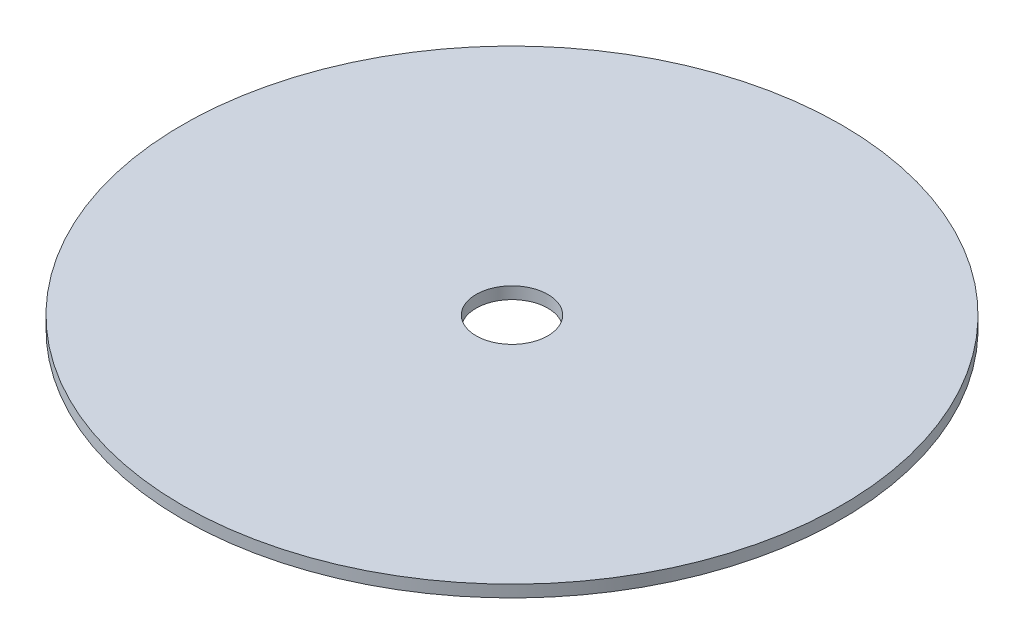
ISO-10303-21;
HEADER;
FILE_DESCRIPTION(('STEP AP214'),'2;1');
FILE_NAME('part.step','',(''),(''),'','','');
FILE_SCHEMA(('AUTOMOTIVE_DESIGN { 1 0 10303 214 1 1 1 1 }'));
ENDSEC;
DATA;
#1=APPLICATION_CONTEXT('core data for automotive mechanical design processes');
#2=APPLICATION_PROTOCOL_DEFINITION('international standard','automotive_design',2000,#1);
#3=PRODUCT_CONTEXT('',#1,'mechanical');
#4=PRODUCT('Part','Part','',(#3));
#5=PRODUCT_RELATED_PRODUCT_CATEGORY('part','',(#4));
#6=PRODUCT_DEFINITION_FORMATION('','',#4);
#7=PRODUCT_DEFINITION_CONTEXT('part definition',#1,'design');
#8=PRODUCT_DEFINITION('design','',#6,#7);
#9=PRODUCT_DEFINITION_SHAPE('','',#8);
#10=(LENGTH_UNIT() NAMED_UNIT(*) SI_UNIT(.MILLI.,.METRE.));
#11=(NAMED_UNIT(*) PLANE_ANGLE_UNIT() SI_UNIT($,.RADIAN.));
#12=(NAMED_UNIT(*) SI_UNIT($,.STERADIAN.) SOLID_ANGLE_UNIT());
#13=UNCERTAINTY_MEASURE_WITH_UNIT(LENGTH_MEASURE(1.E-05),#10,'distance_accuracy_value','');
#14=(GEOMETRIC_REPRESENTATION_CONTEXT(3) GLOBAL_UNCERTAINTY_ASSIGNED_CONTEXT((#13)) GLOBAL_UNIT_ASSIGNED_CONTEXT((#10,
#11,#12)) REPRESENTATION_CONTEXT('',''));
#15=CARTESIAN_POINT('',(0.,0.,0.));
#16=DIRECTION('',(0.,0.,1.));
#17=DIRECTION('',(1.,0.,0.));
#18=AXIS2_PLACEMENT_3D('',#15,#16,#17);
#19=CARTESIAN_POINT('',(0.,0.,0.));
#20=DIRECTION('',(0.,1.,0.));
#21=DIRECTION('',(0.,0.,1.));
#22=AXIS2_PLACEMENT_3D('',#19,#20,#21);
#23=PLANE('',#22);
#24=CARTESIAN_POINT('',(0.,0.,0.));
#25=DIRECTION('',(0.,1.,0.));
#26=DIRECTION('',(0.,0.,1.));
#27=AXIS2_PLACEMENT_3D('',#24,#25,#26);
#28=CIRCLE('',#27,2.7);
#29=CARTESIAN_POINT('',(0.,0.,2.7));
#30=VERTEX_POINT('',#29);
#31=EDGE_CURVE('E54',#30,#30,#28,.T.);
#32=ORIENTED_EDGE('',*,*,#31,.T.);
#33=EDGE_LOOP('',(#32));
#34=FACE_BOUND('',#33,.T.);
#35=CARTESIAN_POINT('',(0.,0.,0.));
#36=DIRECTION('',(0.,-1.,0.));
#37=DIRECTION('',(0.,0.,-1.));
#38=AXIS2_PLACEMENT_3D('',#35,#36,#37);
#39=CIRCLE('',#38,10.15);
#40=CARTESIAN_POINT('',(0.,0.,-10.15));
#41=VERTEX_POINT('',#40);
#42=EDGE_CURVE('E63',#41,#41,#39,.T.);
#43=ORIENTED_EDGE('',*,*,#42,.T.);
#44=EDGE_LOOP('',(#43));
#45=FACE_BOUND('',#44,.T.);
#46=ADVANCED_FACE('F34',(#34,#45),#23,.F.);
#47=CARTESIAN_POINT('',(0.,0.9,0.));
#48=DIRECTION('',(0.,1.,0.));
#49=DIRECTION('',(0.,0.,1.));
#50=AXIS2_PLACEMENT_3D('',#47,#48,#49);
#51=PLANE('',#50);
#52=CARTESIAN_POINT('',(0.,0.9,0.));
#53=DIRECTION('',(0.,1.,0.));
#54=DIRECTION('',(0.,0.,1.));
#55=AXIS2_PLACEMENT_3D('',#52,#53,#54);
#56=CIRCLE('',#55,24.8);
#57=CARTESIAN_POINT('',(0.,0.9,24.8));
#58=VERTEX_POINT('',#57);
#59=EDGE_CURVE('E42',#58,#58,#56,.T.);
#60=ORIENTED_EDGE('',*,*,#59,.T.);
#61=EDGE_LOOP('',(#60));
#62=FACE_BOUND('',#61,.T.);
#63=CARTESIAN_POINT('',(0.,0.9,0.));
#64=DIRECTION('',(0.,1.,0.));
#65=DIRECTION('',(0.,0.,1.));
#66=AXIS2_PLACEMENT_3D('',#63,#64,#65);
#67=CIRCLE('',#66,2.7);
#68=CARTESIAN_POINT('',(0.,0.9,2.7));
#69=VERTEX_POINT('',#68);
#70=EDGE_CURVE('E51',#69,#69,#67,.T.);
#71=ORIENTED_EDGE('',*,*,#70,.F.);
#72=EDGE_LOOP('',(#71));
#73=FACE_BOUND('',#72,.T.);
#74=ADVANCED_FACE('F83',(#62,#73),#51,.T.);
#75=CARTESIAN_POINT('',(0.,0.,0.));
#76=DIRECTION('',(0.,-1.,0.));
#77=DIRECTION('',(0.,0.,-1.));
#78=AXIS2_PLACEMENT_3D('',#75,#76,#77);
#79=CIRCLE('',#78,21.2);
#80=CARTESIAN_POINT('',(0.,0.,-21.2));
#81=VERTEX_POINT('',#80);
#82=EDGE_CURVE('E10',#81,#81,#79,.T.);
#83=ORIENTED_EDGE('',*,*,#82,.F.);
#84=EDGE_LOOP('',(#83));
#85=FACE_BOUND('',#84,.T.);
#86=CARTESIAN_POINT('',(0.,0.,0.));
#87=DIRECTION('',(0.,1.,0.));
#88=DIRECTION('',(0.,0.,1.));
#89=AXIS2_PLACEMENT_3D('',#86,#87,#88);
#90=CIRCLE('',#89,24.8);
#91=CARTESIAN_POINT('',(0.,0.,24.8));
#92=VERTEX_POINT('',#91);
#93=EDGE_CURVE('E38',#92,#92,#90,.T.);
#94=ORIENTED_EDGE('',*,*,#93,.F.);
#95=EDGE_LOOP('',(#94));
#96=FACE_BOUND('',#95,.T.);
#97=ADVANCED_FACE('F84',(#85,#96),#23,.F.);
#98=CARTESIAN_POINT('',(0.,0.9,0.));
#99=DIRECTION('',(0.,-1.,0.));
#100=DIRECTION('',(0.,0.,-1.));
#101=AXIS2_PLACEMENT_3D('',#98,#99,#100);
#102=CYLINDRICAL_SURFACE('',#101,24.8);
#103=ORIENTED_EDGE('',*,*,#59,.F.);
#104=EDGE_LOOP('',(#103));
#105=FACE_BOUND('',#104,.T.);
#106=ORIENTED_EDGE('',*,*,#93,.T.);
#107=EDGE_LOOP('',(#106));
#108=FACE_BOUND('',#107,.T.);
#109=ADVANCED_FACE('F36',(#105,#108),#102,.T.);
#110=CARTESIAN_POINT('',(0.,0.9,0.));
#111=DIRECTION('',(0.,-1.,0.));
#112=DIRECTION('',(0.,0.,-1.));
#113=AXIS2_PLACEMENT_3D('',#110,#111,#112);
#114=CYLINDRICAL_SURFACE('',#113,2.7);
#115=ORIENTED_EDGE('',*,*,#70,.T.);
#116=EDGE_LOOP('',(#115));
#117=FACE_BOUND('',#116,.T.);
#118=ORIENTED_EDGE('',*,*,#31,.F.);
#119=EDGE_LOOP('',(#118));
#120=FACE_BOUND('',#119,.T.);
#121=ADVANCED_FACE('F95',(#117,#120),#114,.F.);
#122=CARTESIAN_POINT('',(0.,-2.25,0.));
#123=DIRECTION('',(0.,-1.,0.));
#124=DIRECTION('',(0.,0.,-1.));
#125=AXIS2_PLACEMENT_3D('',#122,#123,#124);
#126=PLANE('',#125);
#127=CARTESIAN_POINT('',(0.,-2.25,0.));
#128=DIRECTION('',(0.,-1.,0.));
#129=DIRECTION('',(0.,0.,-1.));
#130=AXIS2_PLACEMENT_3D('',#127,#128,#129);
#131=CIRCLE('',#130,21.2);
#132=CARTESIAN_POINT('',(0.,-2.25,-21.2));
#133=VERTEX_POINT('',#132);
#134=EDGE_CURVE('E49',#133,#133,#131,.T.);
#135=ORIENTED_EDGE('',*,*,#134,.T.);
#136=EDGE_LOOP('',(#135));
#137=FACE_BOUND('',#136,.T.);
#138=CARTESIAN_POINT('',(0.,-2.25,0.));
#139=DIRECTION('',(0.,-1.,0.));
#140=DIRECTION('',(0.,0.,-1.));
#141=AXIS2_PLACEMENT_3D('',#138,#139,#140);
#142=CIRCLE('',#141,10.15);
#143=CARTESIAN_POINT('',(0.,-2.25,-10.15));
#144=VERTEX_POINT('',#143);
#145=EDGE_CURVE('E59',#144,#144,#142,.T.);
#146=ORIENTED_EDGE('',*,*,#145,.F.);
#147=EDGE_LOOP('',(#146));
#148=FACE_BOUND('',#147,.T.);
#149=ADVANCED_FACE('F78',(#137,#148),#126,.T.);
#150=CARTESIAN_POINT('',(0.,-2.25,0.));
#151=DIRECTION('',(0.,1.,0.));
#152=DIRECTION('',(0.,0.,1.));
#153=AXIS2_PLACEMENT_3D('',#150,#151,#152);
#154=CYLINDRICAL_SURFACE('',#153,21.2);
#155=ORIENTED_EDGE('',*,*,#134,.F.);
#156=EDGE_LOOP('',(#155));
#157=FACE_BOUND('',#156,.T.);
#158=ORIENTED_EDGE('',*,*,#82,.T.);
#159=EDGE_LOOP('',(#158));
#160=FACE_BOUND('',#159,.T.);
#161=ADVANCED_FACE('F73',(#157,#160),#154,.T.);
#162=CARTESIAN_POINT('',(0.,-2.25,0.));
#163=DIRECTION('',(0.,1.,0.));
#164=DIRECTION('',(0.,0.,1.));
#165=AXIS2_PLACEMENT_3D('',#162,#163,#164);
#166=CYLINDRICAL_SURFACE('',#165,10.15);
#167=ORIENTED_EDGE('',*,*,#145,.T.);
#168=EDGE_LOOP('',(#167));
#169=FACE_BOUND('',#168,.T.);
#170=ORIENTED_EDGE('',*,*,#42,.F.);
#171=EDGE_LOOP('',(#170));
#172=FACE_BOUND('',#171,.T.);
#173=ADVANCED_FACE('F71',(#169,#172),#166,.F.);
#174=CLOSED_SHELL('',(#46,#74,#97,#109,#121,#149,#161,#173));
#175=MANIFOLD_SOLID_BREP('B2',#174);
#176=ADVANCED_BREP_SHAPE_REPRESENTATION('',(#18,#175),#14);
#177=SHAPE_DEFINITION_REPRESENTATION(#9,#176);
ENDSEC;
END-ISO-10303-21;
